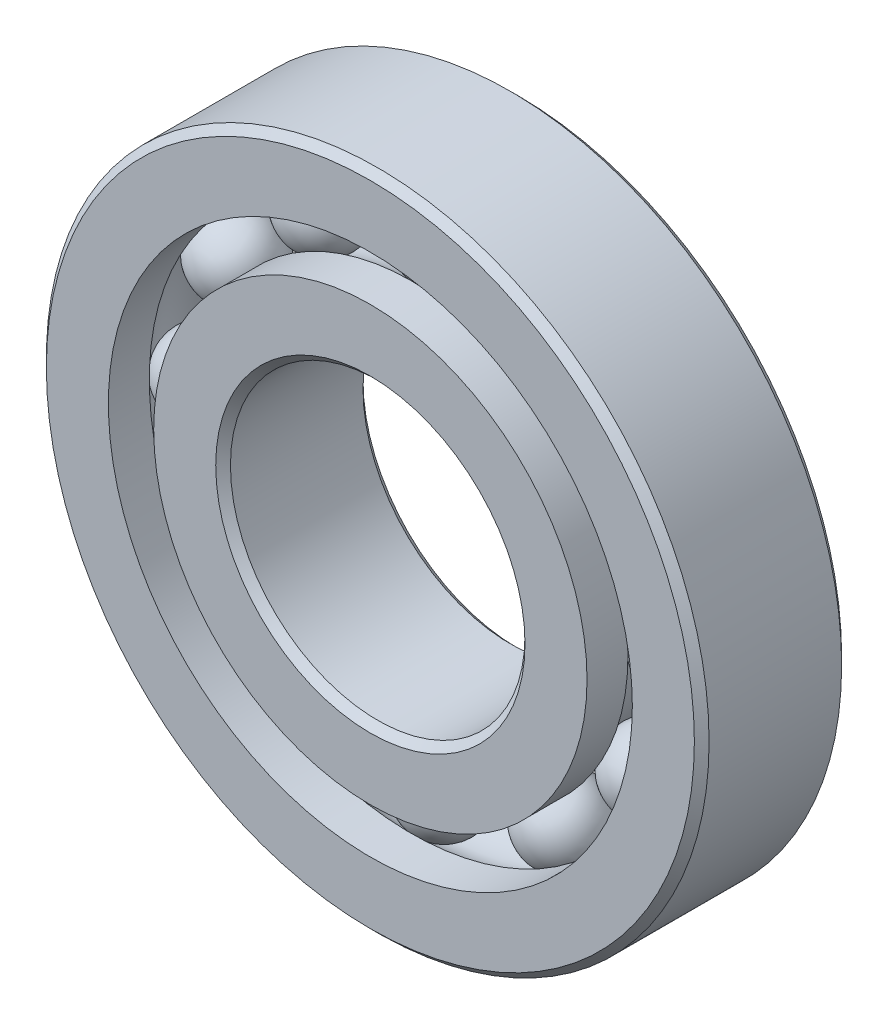
ISO-10303-21;
HEADER;
FILE_DESCRIPTION(('STEP AP214'),'2;1');
FILE_NAME('part.step','',(''),(''),'','','');
FILE_SCHEMA(('AUTOMOTIVE_DESIGN { 1 0 10303 214 1 1 1 1 }'));
ENDSEC;
DATA;
#1=APPLICATION_CONTEXT('core data for automotive mechanical design processes');
#2=APPLICATION_PROTOCOL_DEFINITION('international standard','automotive_design',2000,#1);
#3=PRODUCT_CONTEXT('',#1,'mechanical');
#4=PRODUCT('Part','Part','',(#3));
#5=PRODUCT_RELATED_PRODUCT_CATEGORY('part','',(#4));
#6=PRODUCT_DEFINITION_FORMATION('','',#4);
#7=PRODUCT_DEFINITION_CONTEXT('part definition',#1,'design');
#8=PRODUCT_DEFINITION('design','',#6,#7);
#9=PRODUCT_DEFINITION_SHAPE('','',#8);
#10=(LENGTH_UNIT() NAMED_UNIT(*) SI_UNIT(.MILLI.,.METRE.));
#11=(NAMED_UNIT(*) PLANE_ANGLE_UNIT() SI_UNIT($,.RADIAN.));
#12=(NAMED_UNIT(*) SI_UNIT($,.STERADIAN.) SOLID_ANGLE_UNIT());
#13=UNCERTAINTY_MEASURE_WITH_UNIT(LENGTH_MEASURE(1.E-05),#10,'distance_accuracy_value','');
#14=(GEOMETRIC_REPRESENTATION_CONTEXT(3) GLOBAL_UNCERTAINTY_ASSIGNED_CONTEXT((#13)) GLOBAL_UNIT_ASSIGNED_CONTEXT((#10,
#11,#12)) REPRESENTATION_CONTEXT('',''));
#15=CARTESIAN_POINT('',(0.,0.,0.));
#16=DIRECTION('',(0.,0.,1.));
#17=DIRECTION('',(1.,0.,0.));
#18=AXIS2_PLACEMENT_3D('',#15,#16,#17);
#19=CARTESIAN_POINT('',(-5.15937499999989,8.93629963530074,0.));
#20=DIRECTION('',(0.,0.,1.));
#21=DIRECTION('',(-0.499999999999989,0.866025403784445,0.));
#22=AXIS2_PLACEMENT_3D('',#19,#20,#21);
#23=SPHERICAL_SURFACE('',#22,1.71627890103156);
#24=CARTESIAN_POINT('',(-5.15937499999989,8.93629963530074,1.71627890103155));
#25=VERTEX_POINT('',#24);
#26=VERTEX_LOOP('',#25);
#27=FACE_BOUND('',#26,.T.);
#28=ADVANCED_FACE('F45',(#27),#23,.T.);
#29=CLOSED_SHELL('',(#28));
#30=MANIFOLD_SOLID_BREP('B2',#29);
#31=CARTESIAN_POINT('',(-8.93629963530062,5.1593750000001,0.));
#32=DIRECTION('',(0.,0.,1.));
#33=DIRECTION('',(-0.866025403784433,0.50000000000001,0.));
#34=AXIS2_PLACEMENT_3D('',#31,#32,#33);
#35=SPHERICAL_SURFACE('',#34,1.71627890103156);
#36=CARTESIAN_POINT('',(-8.93629963530062,5.1593750000001,1.71627890103155));
#37=VERTEX_POINT('',#36);
#38=VERTEX_LOOP('',#37);
#39=FACE_BOUND('',#38,.T.);
#40=ADVANCED_FACE('F79',(#39),#35,.T.);
#41=CLOSED_SHELL('',(#40));
#42=MANIFOLD_SOLID_BREP('B6',#41);
#43=CARTESIAN_POINT('',(-10.31875,1.08083231797342E-13,0.));
#44=DIRECTION('',(0.,0.,1.));
#45=DIRECTION('',(-1.,0.,0.));
#46=AXIS2_PLACEMENT_3D('',#43,#44,#45);
#47=SPHERICAL_SURFACE('',#46,1.71627890103156);
#48=CARTESIAN_POINT('',(-10.31875,1.08083231797342E-13,1.71627890103155));
#49=VERTEX_POINT('',#48);
#50=VERTEX_LOOP('',#49);
#51=FACE_BOUND('',#50,.T.);
#52=ADVANCED_FACE('F113',(#51),#47,.T.);
#53=CLOSED_SHELL('',(#52));
#54=MANIFOLD_SOLID_BREP('B41',#53);
#55=CARTESIAN_POINT('',(-8.93629963530072,-5.15937499999992,0.));
#56=DIRECTION('',(0.,0.,1.));
#57=DIRECTION('',(-0.866025403784443,-0.499999999999992,0.));
#58=AXIS2_PLACEMENT_3D('',#55,#56,#57);
#59=SPHERICAL_SURFACE('',#58,1.71627890103156);
#60=CARTESIAN_POINT('',(-8.93629963530072,-5.15937499999992,1.71627890103155));
#61=VERTEX_POINT('',#60);
#62=VERTEX_LOOP('',#61);
#63=FACE_BOUND('',#62,.T.);
#64=ADVANCED_FACE('F147',(#63),#59,.T.);
#65=CLOSED_SHELL('',(#64));
#66=MANIFOLD_SOLID_BREP('B75',#65);
#67=CARTESIAN_POINT('',(-5.15937500000007,-8.93629963530064,0.));
#68=DIRECTION('',(0.,0.,1.));
#69=DIRECTION('',(-0.500000000000007,-0.866025403784435,0.));
#70=AXIS2_PLACEMENT_3D('',#67,#68,#69);
#71=SPHERICAL_SURFACE('',#70,1.71627890103156);
#72=CARTESIAN_POINT('',(-5.15937500000007,-8.93629963530064,1.71627890103155));
#73=VERTEX_POINT('',#72);
#74=VERTEX_LOOP('',#73);
#75=FACE_BOUND('',#74,.T.);
#76=ADVANCED_FACE('F181',(#75),#71,.T.);
#77=CLOSED_SHELL('',(#76));
#78=MANIFOLD_SOLID_BREP('B109',#77);
#79=CARTESIAN_POINT('',(0.,-10.31875,0.));
#80=DIRECTION('',(0.,0.,1.));
#81=DIRECTION('',(0.,-1.,0.));
#82=AXIS2_PLACEMENT_3D('',#79,#80,#81);
#83=SPHERICAL_SURFACE('',#82,1.71627890103156);
#84=CARTESIAN_POINT('',(0.,-10.31875,1.71627890103155));
#85=VERTEX_POINT('',#84);
#86=VERTEX_LOOP('',#85);
#87=FACE_BOUND('',#86,.T.);
#88=ADVANCED_FACE('F216',(#87),#83,.T.);
#89=CLOSED_SHELL('',(#88));
#90=MANIFOLD_SOLID_BREP('B143',#89);
#91=CARTESIAN_POINT('',(5.15937499999995,-8.93629963530071,0.));
#92=DIRECTION('',(0.,0.,1.));
#93=DIRECTION('',(0.499999999999995,-0.866025403784442,0.));
#94=AXIS2_PLACEMENT_3D('',#91,#92,#93);
#95=SPHERICAL_SURFACE('',#94,1.71627890103156);
#96=CARTESIAN_POINT('',(5.15937499999995,-8.93629963530071,1.71627890103155));
#97=VERTEX_POINT('',#96);
#98=VERTEX_LOOP('',#97);
#99=FACE_BOUND('',#98,.T.);
#100=ADVANCED_FACE('F250',(#99),#95,.T.);
#101=CLOSED_SHELL('',(#100));
#102=MANIFOLD_SOLID_BREP('B177',#101);
#103=CARTESIAN_POINT('',(8.93629963530065,-5.15937500000004,0.));
#104=DIRECTION('',(0.,0.,1.));
#105=DIRECTION('',(0.866025403784436,-0.500000000000004,0.));
#106=AXIS2_PLACEMENT_3D('',#103,#104,#105);
#107=SPHERICAL_SURFACE('',#106,1.71627890103156);
#108=CARTESIAN_POINT('',(8.93629963530065,-5.15937500000004,1.71627890103155));
#109=VERTEX_POINT('',#108);
#110=VERTEX_LOOP('',#109);
#111=FACE_BOUND('',#110,.T.);
#112=ADVANCED_FACE('F285',(#111),#107,.T.);
#113=CLOSED_SHELL('',(#112));
#114=MANIFOLD_SOLID_BREP('B212',#113);
#115=CARTESIAN_POINT('',(10.31875,0.,0.));
#116=DIRECTION('',(0.,0.,1.));
#117=DIRECTION('',(1.,0.,0.));
#118=AXIS2_PLACEMENT_3D('',#115,#116,#117);
#119=SPHERICAL_SURFACE('',#118,1.71627890103156);
#120=CARTESIAN_POINT('',(10.31875,0.,1.71627890103155));
#121=VERTEX_POINT('',#120);
#122=VERTEX_LOOP('',#121);
#123=FACE_BOUND('',#122,.T.);
#124=ADVANCED_FACE('F320',(#123),#119,.T.);
#125=CLOSED_SHELL('',(#124));
#126=MANIFOLD_SOLID_BREP('B246',#125);
#127=CARTESIAN_POINT('',(8.93629963530069,5.15937499999998,0.));
#128=DIRECTION('',(0.,0.,1.));
#129=DIRECTION('',(0.86602540378444,0.499999999999998,0.));
#130=AXIS2_PLACEMENT_3D('',#127,#128,#129);
#131=SPHERICAL_SURFACE('',#130,1.71627890103156);
#132=CARTESIAN_POINT('',(8.93629963530069,5.15937499999998,1.71627890103155));
#133=VERTEX_POINT('',#132);
#134=VERTEX_LOOP('',#133);
#135=FACE_BOUND('',#134,.T.);
#136=ADVANCED_FACE('F354',(#135),#131,.T.);
#137=CLOSED_SHELL('',(#136));
#138=MANIFOLD_SOLID_BREP('B281',#137);
#139=CARTESIAN_POINT('',(5.15937500000001,8.93629963530067,0.));
#140=DIRECTION('',(0.,0.,1.));
#141=DIRECTION('',(0.500000000000001,0.866025403784438,0.));
#142=AXIS2_PLACEMENT_3D('',#139,#140,#141);
#143=SPHERICAL_SURFACE('',#142,1.71627890103156);
#144=CARTESIAN_POINT('',(5.15937500000001,8.93629963530067,1.71627890103155));
#145=VERTEX_POINT('',#144);
#146=VERTEX_LOOP('',#145);
#147=FACE_BOUND('',#146,.T.);
#148=ADVANCED_FACE('F388',(#147),#143,.T.);
#149=CLOSED_SHELL('',(#148));
#150=MANIFOLD_SOLID_BREP('B316',#149);
#151=CARTESIAN_POINT('',(0.,10.31875,0.));
#152=DIRECTION('',(0.,0.,1.));
#153=DIRECTION('',(0.,1.,0.));
#154=AXIS2_PLACEMENT_3D('',#151,#152,#153);
#155=SPHERICAL_SURFACE('',#154,1.71627890103156);
#156=CARTESIAN_POINT('',(0.,10.31875,1.71627890103155));
#157=VERTEX_POINT('',#156);
#158=VERTEX_LOOP('',#157);
#159=FACE_BOUND('',#158,.T.);
#160=ADVANCED_FACE('F424',(#159),#155,.T.);
#161=CLOSED_SHELL('',(#160));
#162=MANIFOLD_SOLID_BREP('B350',#161);
#163=CARTESIAN_POINT('',(0.,9.34182692307692,3.175));
#164=DIRECTION('',(0.,0.,-1.));
#165=DIRECTION('',(-1.,0.,0.));
#166=AXIS2_PLACEMENT_3D('',#163,#164,#165);
#167=PLANE('',#166);
#168=CARTESIAN_POINT('',(0.,0.,3.175));
#169=DIRECTION('',(0.,0.,1.));
#170=DIRECTION('',(1.,0.,0.));
#171=AXIS2_PLACEMENT_3D('',#168,#169,#170);
#172=CIRCLE('',#171,6.6675);
#173=CARTESIAN_POINT('',(6.6675,0.,3.175));
#174=VERTEX_POINT('',#173);
#175=EDGE_CURVE('E478',#174,#174,#172,.T.);
#176=ORIENTED_EDGE('',*,*,#175,.F.);
#177=EDGE_LOOP('',(#176));
#178=FACE_BOUND('',#177,.T.);
#179=CARTESIAN_POINT('',(0.,0.,3.175));
#180=DIRECTION('',(0.,0.,1.));
#181=DIRECTION('',(1.,0.,0.));
#182=AXIS2_PLACEMENT_3D('',#179,#180,#181);
#183=CIRCLE('',#182,9.34182692307692);
#184=CARTESIAN_POINT('',(9.34182692307692,0.,3.175));
#185=VERTEX_POINT('',#184);
#186=EDGE_CURVE('E423',#185,#185,#183,.T.);
#187=ORIENTED_EDGE('',*,*,#186,.T.);
#188=EDGE_LOOP('',(#187));
#189=FACE_BOUND('',#188,.T.);
#190=ADVANCED_FACE('F443',(#178,#189),#167,.F.);
#191=CARTESIAN_POINT('',(0.,0.,3.175));
#192=DIRECTION('',(0.,0.,1.));
#193=DIRECTION('',(1.,0.,0.));
#194=AXIS2_PLACEMENT_3D('',#191,#192,#193);
#195=CYLINDRICAL_SURFACE('',#194,9.34182692307692);
#196=ORIENTED_EDGE('',*,*,#186,.F.);
#197=EDGE_LOOP('',(#196));
#198=FACE_BOUND('',#197,.T.);
#199=CARTESIAN_POINT('',(0.,0.,1.41111111111111));
#200=DIRECTION('',(0.,0.,1.));
#201=DIRECTION('',(1.,0.,0.));
#202=AXIS2_PLACEMENT_3D('',#199,#200,#201);
#203=CIRCLE('',#202,9.34182692307692);
#204=CARTESIAN_POINT('',(9.34182692307692,0.,1.41111111111111));
#205=VERTEX_POINT('',#204);
#206=EDGE_CURVE('E450',#205,#205,#203,.T.);
#207=ORIENTED_EDGE('',*,*,#206,.T.);
#208=EDGE_LOOP('',(#207));
#209=FACE_BOUND('',#208,.T.);
#210=ADVANCED_FACE('F486',(#198,#209),#195,.T.);
#211=CARTESIAN_POINT('',(0.,0.,0.));
#212=DIRECTION('',(0.,0.,1.));
#213=DIRECTION('',(1.,0.,0.));
#214=AXIS2_PLACEMENT_3D('',#211,#212,#213);
#215=TOROIDAL_SURFACE('',#214,10.31875,1.71627890103155);
#216=ORIENTED_EDGE('',*,*,#206,.F.);
#217=EDGE_LOOP('',(#216));
#218=FACE_BOUND('',#217,.T.);
#219=CARTESIAN_POINT('',(0.,0.,-1.41111111111111));
#220=DIRECTION('',(0.,0.,1.));
#221=DIRECTION('',(1.,0.,0.));
#222=AXIS2_PLACEMENT_3D('',#219,#220,#221);
#223=CIRCLE('',#222,9.34182692307692);
#224=CARTESIAN_POINT('',(9.34182692307692,0.,-1.41111111111111));
#225=VERTEX_POINT('',#224);
#226=EDGE_CURVE('E456',#225,#225,#223,.T.);
#227=ORIENTED_EDGE('',*,*,#226,.T.);
#228=EDGE_LOOP('',(#227));
#229=FACE_BOUND('',#228,.T.);
#230=ADVANCED_FACE('F490',(#218,#229),#215,.F.);
#231=CARTESIAN_POINT('',(0.,0.,3.175));
#232=DIRECTION('',(0.,0.,1.));
#233=DIRECTION('',(1.,0.,0.));
#234=AXIS2_PLACEMENT_3D('',#231,#232,#233);
#235=CYLINDRICAL_SURFACE('',#234,9.34182692307692);
#236=ORIENTED_EDGE('',*,*,#226,.F.);
#237=EDGE_LOOP('',(#236));
#238=FACE_BOUND('',#237,.T.);
#239=CARTESIAN_POINT('',(0.,0.,-3.175));
#240=DIRECTION('',(0.,0.,1.));
#241=DIRECTION('',(1.,0.,0.));
#242=AXIS2_PLACEMENT_3D('',#239,#240,#241);
#243=CIRCLE('',#242,9.34182692307692);
#244=CARTESIAN_POINT('',(9.34182692307692,0.,-3.175));
#245=VERTEX_POINT('',#244);
#246=EDGE_CURVE('E461',#245,#245,#243,.T.);
#247=ORIENTED_EDGE('',*,*,#246,.T.);
#248=EDGE_LOOP('',(#247));
#249=FACE_BOUND('',#248,.T.);
#250=ADVANCED_FACE('F495',(#238,#249),#235,.T.);
#251=CARTESIAN_POINT('',(0.,6.6675,-3.175));
#252=DIRECTION('',(0.,0.,1.));
#253=DIRECTION('',(1.,0.,0.));
#254=AXIS2_PLACEMENT_3D('',#251,#252,#253);
#255=PLANE('',#254);
#256=ORIENTED_EDGE('',*,*,#246,.F.);
#257=EDGE_LOOP('',(#256));
#258=FACE_BOUND('',#257,.T.);
#259=CARTESIAN_POINT('',(0.,0.,-3.175));
#260=DIRECTION('',(0.,0.,1.));
#261=DIRECTION('',(1.,0.,0.));
#262=AXIS2_PLACEMENT_3D('',#259,#260,#261);
#263=CIRCLE('',#262,6.6675);
#264=CARTESIAN_POINT('',(6.6675,0.,-3.175));
#265=VERTEX_POINT('',#264);
#266=EDGE_CURVE('E467',#265,#265,#263,.T.);
#267=ORIENTED_EDGE('',*,*,#266,.T.);
#268=EDGE_LOOP('',(#267));
#269=FACE_BOUND('',#268,.T.);
#270=ADVANCED_FACE('F501',(#258,#269),#255,.F.);
#271=CARTESIAN_POINT('',(0.,0.,-2.8575));
#272=DIRECTION('',(0.,0.,-1.));
#273=DIRECTION('',(-1.,0.,0.));
#274=AXIS2_PLACEMENT_3D('',#271,#272,#273);
#275=CONICAL_SURFACE('',#274,6.35,0.785398163397452);
#276=ORIENTED_EDGE('',*,*,#266,.F.);
#277=EDGE_LOOP('',(#276));
#278=FACE_BOUND('',#277,.T.);
#279=CARTESIAN_POINT('',(0.,0.,-2.8575));
#280=DIRECTION('',(0.,0.,1.));
#281=DIRECTION('',(1.,0.,0.));
#282=AXIS2_PLACEMENT_3D('',#279,#280,#281);
#283=CIRCLE('',#282,6.35);
#284=CARTESIAN_POINT('',(6.35,0.,-2.8575));
#285=VERTEX_POINT('',#284);
#286=EDGE_CURVE('E470',#285,#285,#283,.T.);
#287=ORIENTED_EDGE('',*,*,#286,.T.);
#288=EDGE_LOOP('',(#287));
#289=FACE_BOUND('',#288,.T.);
#290=ADVANCED_FACE('F505',(#278,#289),#275,.F.);
#291=CARTESIAN_POINT('',(0.,0.,3.175));
#292=DIRECTION('',(0.,0.,1.));
#293=DIRECTION('',(1.,0.,0.));
#294=AXIS2_PLACEMENT_3D('',#291,#292,#293);
#295=CYLINDRICAL_SURFACE('',#294,6.35);
#296=ORIENTED_EDGE('',*,*,#286,.F.);
#297=EDGE_LOOP('',(#296));
#298=FACE_BOUND('',#297,.T.);
#299=CARTESIAN_POINT('',(0.,0.,2.8575));
#300=DIRECTION('',(0.,0.,1.));
#301=DIRECTION('',(1.,0.,0.));
#302=AXIS2_PLACEMENT_3D('',#299,#300,#301);
#303=CIRCLE('',#302,6.35);
#304=CARTESIAN_POINT('',(6.35,0.,2.8575));
#305=VERTEX_POINT('',#304);
#306=EDGE_CURVE('E474',#305,#305,#303,.T.);
#307=ORIENTED_EDGE('',*,*,#306,.T.);
#308=EDGE_LOOP('',(#307));
#309=FACE_BOUND('',#308,.T.);
#310=ADVANCED_FACE('F509',(#298,#309),#295,.F.);
#311=CARTESIAN_POINT('',(0.,0.,3.175));
#312=DIRECTION('',(0.,0.,1.));
#313=DIRECTION('',(1.,0.,0.));
#314=AXIS2_PLACEMENT_3D('',#311,#312,#313);
#315=CONICAL_SURFACE('',#314,6.6675,0.785398163397444);
#316=ORIENTED_EDGE('',*,*,#306,.F.);
#317=EDGE_LOOP('',(#316));
#318=FACE_BOUND('',#317,.T.);
#319=ORIENTED_EDGE('',*,*,#175,.T.);
#320=EDGE_LOOP('',(#319));
#321=FACE_BOUND('',#320,.T.);
#322=ADVANCED_FACE('F483',(#318,#321),#315,.F.);
#323=CLOSED_SHELL('',(#190,#210,#230,#250,#270,#290,#310,#322));
#324=MANIFOLD_SOLID_BREP('B384',#323);
#325=CARTESIAN_POINT('',(0.,0.,2.8575));
#326=DIRECTION('',(0.,0.,-1.));
#327=DIRECTION('',(-1.,0.,0.));
#328=AXIS2_PLACEMENT_3D('',#325,#326,#327);
#329=CONICAL_SURFACE('',#328,14.2875,0.785398163397448);
#330=CARTESIAN_POINT('',(0.,0.,3.175));
#331=DIRECTION('',(0.,0.,1.));
#332=DIRECTION('',(1.,0.,0.));
#333=AXIS2_PLACEMENT_3D('',#330,#331,#332);
#334=CIRCLE('',#333,13.97);
#335=CARTESIAN_POINT('',(13.97,0.,3.175));
#336=VERTEX_POINT('',#335);
#337=EDGE_CURVE('E615',#336,#336,#334,.T.);
#338=ORIENTED_EDGE('',*,*,#337,.F.);
#339=EDGE_LOOP('',(#338));
#340=FACE_BOUND('',#339,.T.);
#341=CARTESIAN_POINT('',(0.,0.,2.8575));
#342=DIRECTION('',(0.,0.,1.));
#343=DIRECTION('',(1.,0.,0.));
#344=AXIS2_PLACEMENT_3D('',#341,#342,#343);
#345=CIRCLE('',#344,14.2875);
#346=CARTESIAN_POINT('',(14.2875,0.,2.8575));
#347=VERTEX_POINT('',#346);
#348=EDGE_CURVE('E442',#347,#347,#345,.T.);
#349=ORIENTED_EDGE('',*,*,#348,.T.);
#350=EDGE_LOOP('',(#349));
#351=FACE_BOUND('',#350,.T.);
#352=ADVANCED_FACE('F579',(#340,#351),#329,.T.);
#353=CARTESIAN_POINT('',(0.,0.,3.175));
#354=DIRECTION('',(0.,0.,1.));
#355=DIRECTION('',(1.,0.,0.));
#356=AXIS2_PLACEMENT_3D('',#353,#354,#355);
#357=CYLINDRICAL_SURFACE('',#356,14.2875);
#358=ORIENTED_EDGE('',*,*,#348,.F.);
#359=EDGE_LOOP('',(#358));
#360=FACE_BOUND('',#359,.T.);
#361=CARTESIAN_POINT('',(0.,0.,-2.8575));
#362=DIRECTION('',(0.,0.,1.));
#363=DIRECTION('',(1.,0.,0.));
#364=AXIS2_PLACEMENT_3D('',#361,#362,#363);
#365=CIRCLE('',#364,14.2875);
#366=CARTESIAN_POINT('',(14.2875,0.,-2.8575));
#367=VERTEX_POINT('',#366);
#368=EDGE_CURVE('E586',#367,#367,#365,.T.);
#369=ORIENTED_EDGE('',*,*,#368,.T.);
#370=EDGE_LOOP('',(#369));
#371=FACE_BOUND('',#370,.T.);
#372=ADVANCED_FACE('F622',(#360,#371),#357,.T.);
#373=CARTESIAN_POINT('',(0.,0.,-3.175));
#374=DIRECTION('',(0.,0.,1.));
#375=DIRECTION('',(1.,0.,0.));
#376=AXIS2_PLACEMENT_3D('',#373,#374,#375);
#377=CONICAL_SURFACE('',#376,13.97,0.785398163397448);
#378=ORIENTED_EDGE('',*,*,#368,.F.);
#379=EDGE_LOOP('',(#378));
#380=FACE_BOUND('',#379,.T.);
#381=CARTESIAN_POINT('',(0.,0.,-3.175));
#382=DIRECTION('',(0.,0.,1.));
#383=DIRECTION('',(1.,0.,0.));
#384=AXIS2_PLACEMENT_3D('',#381,#382,#383);
#385=CIRCLE('',#384,13.97);
#386=CARTESIAN_POINT('',(13.97,0.,-3.175));
#387=VERTEX_POINT('',#386);
#388=EDGE_CURVE('E592',#387,#387,#385,.T.);
#389=ORIENTED_EDGE('',*,*,#388,.T.);
#390=EDGE_LOOP('',(#389));
#391=FACE_BOUND('',#390,.T.);
#392=ADVANCED_FACE('F626',(#380,#391),#377,.T.);
#393=CARTESIAN_POINT('',(0.,13.97,-3.175));
#394=DIRECTION('',(0.,0.,1.));
#395=DIRECTION('',(1.,0.,0.));
#396=AXIS2_PLACEMENT_3D('',#393,#394,#395);
#397=PLANE('',#396);
#398=ORIENTED_EDGE('',*,*,#388,.F.);
#399=EDGE_LOOP('',(#398));
#400=FACE_BOUND('',#399,.T.);
#401=CARTESIAN_POINT('',(0.,0.,-3.175));
#402=DIRECTION('',(0.,0.,1.));
#403=DIRECTION('',(1.,0.,0.));
#404=AXIS2_PLACEMENT_3D('',#401,#402,#403);
#405=CIRCLE('',#404,11.2956730769231);
#406=CARTESIAN_POINT('',(11.2956730769231,0.,-3.175));
#407=VERTEX_POINT('',#406);
#408=EDGE_CURVE('E597',#407,#407,#405,.T.);
#409=ORIENTED_EDGE('',*,*,#408,.T.);
#410=EDGE_LOOP('',(#409));
#411=FACE_BOUND('',#410,.T.);
#412=ADVANCED_FACE('F631',(#400,#411),#397,.F.);
#413=CARTESIAN_POINT('',(0.,0.,3.175));
#414=DIRECTION('',(0.,0.,1.));
#415=DIRECTION('',(1.,0.,0.));
#416=AXIS2_PLACEMENT_3D('',#413,#414,#415);
#417=CYLINDRICAL_SURFACE('',#416,11.2956730769231);
#418=ORIENTED_EDGE('',*,*,#408,.F.);
#419=EDGE_LOOP('',(#418));
#420=FACE_BOUND('',#419,.T.);
#421=CARTESIAN_POINT('',(0.,0.,-1.41111111111111));
#422=DIRECTION('',(0.,0.,1.));
#423=DIRECTION('',(1.,0.,0.));
#424=AXIS2_PLACEMENT_3D('',#421,#422,#423);
#425=CIRCLE('',#424,11.2956730769231);
#426=CARTESIAN_POINT('',(11.2956730769231,0.,-1.41111111111111));
#427=VERTEX_POINT('',#426);
#428=EDGE_CURVE('E603',#427,#427,#425,.T.);
#429=ORIENTED_EDGE('',*,*,#428,.T.);
#430=EDGE_LOOP('',(#429));
#431=FACE_BOUND('',#430,.T.);
#432=ADVANCED_FACE('F637',(#420,#431),#417,.F.);
#433=CARTESIAN_POINT('',(0.,0.,0.));
#434=DIRECTION('',(0.,0.,1.));
#435=DIRECTION('',(1.,0.,0.));
#436=AXIS2_PLACEMENT_3D('',#433,#434,#435);
#437=TOROIDAL_SURFACE('',#436,10.31875,1.71627890103156);
#438=ORIENTED_EDGE('',*,*,#428,.F.);
#439=EDGE_LOOP('',(#438));
#440=FACE_BOUND('',#439,.T.);
#441=CARTESIAN_POINT('',(0.,0.,1.41111111111111));
#442=DIRECTION('',(0.,0.,1.));
#443=DIRECTION('',(1.,0.,0.));
#444=AXIS2_PLACEMENT_3D('',#441,#442,#443);
#445=CIRCLE('',#444,11.2956730769231);
#446=CARTESIAN_POINT('',(11.2956730769231,0.,1.41111111111111));
#447=VERTEX_POINT('',#446);
#448=EDGE_CURVE('E607',#447,#447,#445,.T.);
#449=ORIENTED_EDGE('',*,*,#448,.T.);
#450=EDGE_LOOP('',(#449));
#451=FACE_BOUND('',#450,.T.);
#452=ADVANCED_FACE('F641',(#440,#451),#437,.F.);
#453=CARTESIAN_POINT('',(0.,0.,3.175));
#454=DIRECTION('',(0.,0.,1.));
#455=DIRECTION('',(1.,0.,0.));
#456=AXIS2_PLACEMENT_3D('',#453,#454,#455);
#457=CYLINDRICAL_SURFACE('',#456,11.2956730769231);
#458=ORIENTED_EDGE('',*,*,#448,.F.);
#459=EDGE_LOOP('',(#458));
#460=FACE_BOUND('',#459,.T.);
#461=CARTESIAN_POINT('',(0.,0.,3.175));
#462=DIRECTION('',(0.,0.,1.));
#463=DIRECTION('',(1.,0.,0.));
#464=AXIS2_PLACEMENT_3D('',#461,#462,#463);
#465=CIRCLE('',#464,11.2956730769231);
#466=CARTESIAN_POINT('',(11.2956730769231,0.,3.175));
#467=VERTEX_POINT('',#466);
#468=EDGE_CURVE('E611',#467,#467,#465,.T.);
#469=ORIENTED_EDGE('',*,*,#468,.T.);
#470=EDGE_LOOP('',(#469));
#471=FACE_BOUND('',#470,.T.);
#472=ADVANCED_FACE('F645',(#460,#471),#457,.F.);
#473=CARTESIAN_POINT('',(0.,13.97,3.175));
#474=DIRECTION('',(0.,0.,-1.));
#475=DIRECTION('',(-1.,0.,0.));
#476=AXIS2_PLACEMENT_3D('',#473,#474,#475);
#477=PLANE('',#476);
#478=ORIENTED_EDGE('',*,*,#468,.F.);
#479=EDGE_LOOP('',(#478));
#480=FACE_BOUND('',#479,.T.);
#481=ORIENTED_EDGE('',*,*,#337,.T.);
#482=EDGE_LOOP('',(#481));
#483=FACE_BOUND('',#482,.T.);
#484=ADVANCED_FACE('F619',(#480,#483),#477,.F.);
#485=CLOSED_SHELL('',(#352,#372,#392,#412,#432,#452,#472,#484));
#486=MANIFOLD_SOLID_BREP('B418',#485);
#487=ADVANCED_BREP_SHAPE_REPRESENTATION('',(#18,#30,#42,#54,#66,#78,#90,#102,#114,#126,#138,
#150,#162,#324,#486),#14);
#488=SHAPE_DEFINITION_REPRESENTATION(#9,#487);
ENDSEC;
END-ISO-10303-21;
